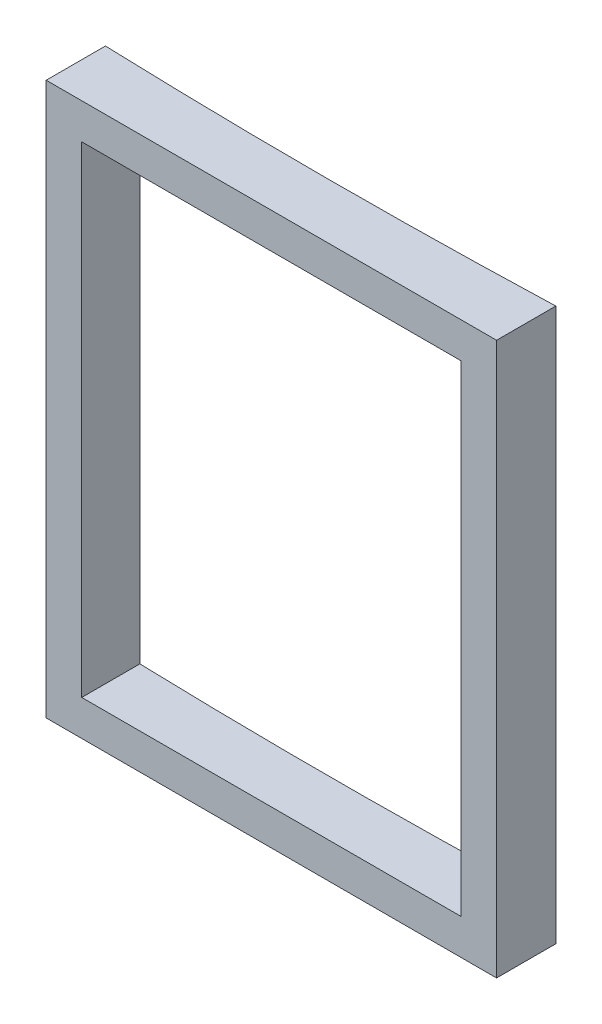
ISO-10303-21;
HEADER;
FILE_DESCRIPTION(('STEP AP214'),'2;1');
FILE_NAME('part.step','',(''),(''),'','','');
FILE_SCHEMA(('AUTOMOTIVE_DESIGN { 1 0 10303 214 1 1 1 1 }'));
ENDSEC;
DATA;
#1=APPLICATION_CONTEXT('core data for automotive mechanical design processes');
#2=APPLICATION_PROTOCOL_DEFINITION('international standard','automotive_design',2000,#1);
#3=PRODUCT_CONTEXT('',#1,'mechanical');
#4=PRODUCT('Part','Part','',(#3));
#5=PRODUCT_RELATED_PRODUCT_CATEGORY('part','',(#4));
#6=PRODUCT_DEFINITION_FORMATION('','',#4);
#7=PRODUCT_DEFINITION_CONTEXT('part definition',#1,'design');
#8=PRODUCT_DEFINITION('design','',#6,#7);
#9=PRODUCT_DEFINITION_SHAPE('','',#8);
#10=(LENGTH_UNIT() NAMED_UNIT(*) SI_UNIT(.MILLI.,.METRE.));
#11=(NAMED_UNIT(*) PLANE_ANGLE_UNIT() SI_UNIT($,.RADIAN.));
#12=(NAMED_UNIT(*) SI_UNIT($,.STERADIAN.) SOLID_ANGLE_UNIT());
#13=UNCERTAINTY_MEASURE_WITH_UNIT(LENGTH_MEASURE(1.E-05),#10,'distance_accuracy_value','');
#14=(GEOMETRIC_REPRESENTATION_CONTEXT(3) GLOBAL_UNCERTAINTY_ASSIGNED_CONTEXT((#13)) GLOBAL_UNIT_ASSIGNED_CONTEXT((#10,
#11,#12)) REPRESENTATION_CONTEXT('',''));
#15=CARTESIAN_POINT('',(0.,0.,0.));
#16=DIRECTION('',(0.,0.,1.));
#17=DIRECTION('',(1.,0.,0.));
#18=AXIS2_PLACEMENT_3D('',#15,#16,#17);
#19=CARTESIAN_POINT('',(-7642.18614314405,2330.,-22466.2180459366));
#20=DIRECTION('',(0.,-1.,0.));
#21=DIRECTION('',(0.,0.,-1.));
#22=AXIS2_PLACEMENT_3D('',#19,#20,#21);
#23=CYLINDRICAL_SURFACE('',#22,27500.);
#24=CARTESIAN_POINT('',(-7642.18614314405,150.,-22466.2180459366));
#25=DIRECTION('',(0.,-1.,0.));
#26=DIRECTION('',(1.,0.,0.));
#27=AXIS2_PLACEMENT_3D('',#24,#25,#26);
#28=CIRCLE('',#27,27500.);
#29=CARTESIAN_POINT('',(-8442.18614314405,150.,5022.14312747641));
#30=VERTEX_POINT('',#29);
#31=CARTESIAN_POINT('',(-6842.18614314405,150.,5022.14312747641));
#32=VERTEX_POINT('',#31);
#33=EDGE_CURVE('E150',#30,#32,#28,.F.);
#34=ORIENTED_EDGE('',*,*,#33,.T.);
#35=DIRECTION('',(0.,-1.,0.));
#36=VECTOR('',#35,1.);
#37=CARTESIAN_POINT('',(-6842.18614314405,2330.,5022.14312747641));
#38=LINE('',#37,#36);
#39=CARTESIAN_POINT('',(-6842.18614314405,2180.,5022.14312747641));
#40=VERTEX_POINT('',#39);
#41=EDGE_CURVE('E154',#32,#40,#38,.F.);
#42=ORIENTED_EDGE('',*,*,#41,.T.);
#43=CARTESIAN_POINT('',(-7642.18614314405,2180.,-22466.2180459366));
#44=DIRECTION('',(0.,1.,0.));
#45=DIRECTION('',(0.,0.,1.));
#46=AXIS2_PLACEMENT_3D('',#43,#44,#45);
#47=CIRCLE('',#46,27500.);
#48=CARTESIAN_POINT('',(-8442.18614314405,2180.,5022.14312747641));
#49=VERTEX_POINT('',#48);
#50=EDGE_CURVE('E141',#40,#49,#47,.F.);
#51=ORIENTED_EDGE('',*,*,#50,.T.);
#52=DIRECTION('',(0.,-1.,0.));
#53=VECTOR('',#52,1.);
#54=CARTESIAN_POINT('',(-8442.18614314405,2330.,5022.14312747641));
#55=LINE('',#54,#53);
#56=EDGE_CURVE('E116',#49,#30,#55,.T.);
#57=ORIENTED_EDGE('',*,*,#56,.T.);
#58=EDGE_LOOP('',(#34,#42,#51,#57));
#59=FACE_BOUND('',#58,.T.);
#60=CARTESIAN_POINT('',(-7642.18614314405,0.,-22466.2180459366));
#61=DIRECTION('',(0.,-1.,0.));
#62=DIRECTION('',(0.,0.,-1.));
#63=AXIS2_PLACEMENT_3D('',#60,#61,#62);
#64=CIRCLE('',#63,27500.);
#65=CARTESIAN_POINT('',(-6692.18614314405,0.,5017.36796462614));
#66=VERTEX_POINT('',#65);
#67=CARTESIAN_POINT('',(-8592.18614314405,0.,5017.36796462614));
#68=VERTEX_POINT('',#67);
#69=EDGE_CURVE('E158',#66,#68,#64,.T.);
#70=ORIENTED_EDGE('',*,*,#69,.T.);
#71=DIRECTION('',(0.,-1.,0.));
#72=VECTOR('',#71,1.);
#73=CARTESIAN_POINT('',(-8592.18614314405,2330.,5017.36796462614));
#74=LINE('',#73,#72);
#75=CARTESIAN_POINT('',(-8592.18614314405,2330.,5017.36796462614));
#76=VERTEX_POINT('',#75);
#77=EDGE_CURVE('E11',#76,#68,#74,.T.);
#78=ORIENTED_EDGE('',*,*,#77,.F.);
#79=CARTESIAN_POINT('',(-7642.18614314405,2330.,-22466.2180459366));
#80=DIRECTION('',(0.,-1.,0.));
#81=DIRECTION('',(0.,0.,-1.));
#82=AXIS2_PLACEMENT_3D('',#79,#80,#81);
#83=CIRCLE('',#82,27500.);
#84=CARTESIAN_POINT('',(-6692.18614314405,2330.,5017.36796462614));
#85=VERTEX_POINT('',#84);
#86=EDGE_CURVE('E159',#85,#76,#83,.T.);
#87=ORIENTED_EDGE('',*,*,#86,.F.);
#88=DIRECTION('',(0.,-1.,0.));
#89=VECTOR('',#88,1.);
#90=CARTESIAN_POINT('',(-6692.18614314405,2330.,5017.36796462614));
#91=LINE('',#90,#89);
#92=EDGE_CURVE('E173',#85,#66,#91,.T.);
#93=ORIENTED_EDGE('',*,*,#92,.T.);
#94=EDGE_LOOP('',(#70,#78,#87,#93));
#95=FACE_BOUND('',#94,.T.);
#96=ADVANCED_FACE('F45',(#59,#95),#23,.F.);
#97=CARTESIAN_POINT('',(-8592.18614314405,2330.,5017.36796462614));
#98=DIRECTION('',(1.,0.,0.));
#99=DIRECTION('',(0.,0.,-1.));
#100=AXIS2_PLACEMENT_3D('',#97,#98,#99);
#101=PLANE('',#100);
#102=DIRECTION('',(0.,0.,1.));
#103=VECTOR('',#102,1.);
#104=CARTESIAN_POINT('',(-8592.18614314405,0.,5017.36796462614));
#105=LINE('',#104,#103);
#106=CARTESIAN_POINT('',(-8592.18614314405,0.,5267.36796462614));
#107=VERTEX_POINT('',#106);
#108=EDGE_CURVE('E177',#68,#107,#105,.T.);
#109=ORIENTED_EDGE('',*,*,#108,.T.);
#110=DIRECTION('',(0.,-1.,0.));
#111=VECTOR('',#110,1.);
#112=CARTESIAN_POINT('',(-8592.18614314405,2330.,5267.36796462614));
#113=LINE('',#112,#111);
#114=CARTESIAN_POINT('',(-8592.18614314405,2330.,5267.36796462614));
#115=VERTEX_POINT('',#114);
#116=EDGE_CURVE('E53',#115,#107,#113,.T.);
#117=ORIENTED_EDGE('',*,*,#116,.F.);
#118=DIRECTION('',(0.,0.,1.));
#119=VECTOR('',#118,1.);
#120=CARTESIAN_POINT('',(-8592.18614314405,2330.,5017.36796462614));
#121=LINE('',#120,#119);
#122=EDGE_CURVE('E163',#76,#115,#121,.T.);
#123=ORIENTED_EDGE('',*,*,#122,.F.);
#124=ORIENTED_EDGE('',*,*,#77,.T.);
#125=EDGE_LOOP('',(#109,#117,#123,#124));
#126=FACE_BOUND('',#125,.T.);
#127=ADVANCED_FACE('F211',(#126),#101,.F.);
#128=CARTESIAN_POINT('',(-8592.18614314405,2330.,5267.36796462614));
#129=DIRECTION('',(0.,0.,-1.));
#130=DIRECTION('',(-1.,0.,0.));
#131=AXIS2_PLACEMENT_3D('',#128,#129,#130);
#132=PLANE('',#131);
#133=DIRECTION('',(-1.,0.,0.));
#134=VECTOR('',#133,1.);
#135=CARTESIAN_POINT('',(-8442.18614314405,2180.,5267.36796462614));
#136=LINE('',#135,#134);
#137=CARTESIAN_POINT('',(-6842.18614314405,2180.,5267.36796462614));
#138=VERTEX_POINT('',#137);
#139=CARTESIAN_POINT('',(-8442.18614314405,2180.,5267.36796462614));
#140=VERTEX_POINT('',#139);
#141=EDGE_CURVE('E123',#138,#140,#136,.T.);
#142=ORIENTED_EDGE('',*,*,#141,.F.);
#143=DIRECTION('',(0.,1.,0.));
#144=VECTOR('',#143,1.);
#145=CARTESIAN_POINT('',(-6842.18614314405,2180.,5267.36796462614));
#146=LINE('',#145,#144);
#147=CARTESIAN_POINT('',(-6842.18614314405,150.,5267.36796462614));
#148=VERTEX_POINT('',#147);
#149=EDGE_CURVE('E68',#148,#138,#146,.T.);
#150=ORIENTED_EDGE('',*,*,#149,.F.);
#151=DIRECTION('',(1.,0.,0.));
#152=VECTOR('',#151,1.);
#153=CARTESIAN_POINT('',(-6842.18614314405,150.,5267.36796462614));
#154=LINE('',#153,#152);
#155=CARTESIAN_POINT('',(-8442.18614314405,150.,5267.36796462614));
#156=VERTEX_POINT('',#155);
#157=EDGE_CURVE('E131',#156,#148,#154,.T.);
#158=ORIENTED_EDGE('',*,*,#157,.F.);
#159=DIRECTION('',(0.,-1.,0.));
#160=VECTOR('',#159,1.);
#161=CARTESIAN_POINT('',(-8442.18614314405,150.,5267.36796462614));
#162=LINE('',#161,#160);
#163=EDGE_CURVE('E113',#140,#156,#162,.T.);
#164=ORIENTED_EDGE('',*,*,#163,.F.);
#165=EDGE_LOOP('',(#142,#150,#158,#164));
#166=FACE_BOUND('',#165,.T.);
#167=DIRECTION('',(1.,0.,0.));
#168=VECTOR('',#167,1.);
#169=CARTESIAN_POINT('',(-8592.18614314405,0.,5267.36796462614));
#170=LINE('',#169,#168);
#171=CARTESIAN_POINT('',(-6692.18614314405,0.,5267.36796462614));
#172=VERTEX_POINT('',#171);
#173=EDGE_CURVE('E180',#107,#172,#170,.T.);
#174=ORIENTED_EDGE('',*,*,#173,.T.);
#175=DIRECTION('',(0.,-1.,0.));
#176=VECTOR('',#175,1.);
#177=CARTESIAN_POINT('',(-6692.18614314405,2330.,5267.36796462614));
#178=LINE('',#177,#176);
#179=CARTESIAN_POINT('',(-6692.18614314405,2330.,5267.36796462614));
#180=VERTEX_POINT('',#179);
#181=EDGE_CURVE('E188',#180,#172,#178,.T.);
#182=ORIENTED_EDGE('',*,*,#181,.F.);
#183=DIRECTION('',(1.,0.,0.));
#184=VECTOR('',#183,1.);
#185=CARTESIAN_POINT('',(-8592.18614314405,2330.,5267.36796462614));
#186=LINE('',#185,#184);
#187=EDGE_CURVE('E167',#115,#180,#186,.T.);
#188=ORIENTED_EDGE('',*,*,#187,.F.);
#189=ORIENTED_EDGE('',*,*,#116,.T.);
#190=EDGE_LOOP('',(#174,#182,#188,#189));
#191=FACE_BOUND('',#190,.T.);
#192=ADVANCED_FACE('F128',(#166,#191),#132,.F.);
#193=CARTESIAN_POINT('',(-6692.18614314405,2330.,5017.36796462614));
#194=DIRECTION('',(-1.,0.,0.));
#195=DIRECTION('',(0.,0.,1.));
#196=AXIS2_PLACEMENT_3D('',#193,#194,#195);
#197=PLANE('',#196);
#198=DIRECTION('',(0.,0.,-1.));
#199=VECTOR('',#198,1.);
#200=CARTESIAN_POINT('',(-6692.18614314405,0.,5017.36796462614));
#201=LINE('',#200,#199);
#202=EDGE_CURVE('E164',#172,#66,#201,.T.);
#203=ORIENTED_EDGE('',*,*,#202,.T.);
#204=ORIENTED_EDGE('',*,*,#92,.F.);
#205=DIRECTION('',(0.,0.,-1.));
#206=VECTOR('',#205,1.);
#207=CARTESIAN_POINT('',(-6692.18614314405,2330.,5017.36796462614));
#208=LINE('',#207,#206);
#209=EDGE_CURVE('E170',#180,#85,#208,.T.);
#210=ORIENTED_EDGE('',*,*,#209,.F.);
#211=ORIENTED_EDGE('',*,*,#181,.T.);
#212=EDGE_LOOP('',(#203,#204,#210,#211));
#213=FACE_BOUND('',#212,.T.);
#214=ADVANCED_FACE('F204',(#213),#197,.F.);
#215=CARTESIAN_POINT('',(-7642.18614314405,2330.,-22466.2180459366));
#216=DIRECTION('',(0.,-1.,0.));
#217=DIRECTION('',(0.,0.,-1.));
#218=AXIS2_PLACEMENT_3D('',#215,#216,#217);
#219=PLANE('',#218);
#220=ORIENTED_EDGE('',*,*,#86,.T.);
#221=ORIENTED_EDGE('',*,*,#122,.T.);
#222=ORIENTED_EDGE('',*,*,#187,.T.);
#223=ORIENTED_EDGE('',*,*,#209,.T.);
#224=EDGE_LOOP('',(#220,#221,#222,#223));
#225=FACE_BOUND('',#224,.T.);
#226=ADVANCED_FACE('F210',(#225),#219,.F.);
#227=CARTESIAN_POINT('',(-7642.18614314405,0.,-22466.2180459366));
#228=DIRECTION('',(0.,-1.,0.));
#229=DIRECTION('',(0.,0.,-1.));
#230=AXIS2_PLACEMENT_3D('',#227,#228,#229);
#231=PLANE('',#230);
#232=ORIENTED_EDGE('',*,*,#69,.F.);
#233=ORIENTED_EDGE('',*,*,#202,.F.);
#234=ORIENTED_EDGE('',*,*,#173,.F.);
#235=ORIENTED_EDGE('',*,*,#108,.F.);
#236=EDGE_LOOP('',(#232,#233,#234,#235));
#237=FACE_BOUND('',#236,.T.);
#238=ADVANCED_FACE('F201',(#237),#231,.T.);
#239=CARTESIAN_POINT('',(-6842.18614314405,2180.,2267.36796462614));
#240=DIRECTION('',(1.,0.,0.));
#241=DIRECTION('',(0.,0.,-1.));
#242=AXIS2_PLACEMENT_3D('',#239,#240,#241);
#243=PLANE('',#242);
#244=DIRECTION('',(0.,0.,1.));
#245=VECTOR('',#244,1.);
#246=CARTESIAN_POINT('',(-6842.18614314405,150.,2267.36796462614));
#247=LINE('',#246,#245);
#248=EDGE_CURVE('E138',#32,#148,#247,.T.);
#249=ORIENTED_EDGE('',*,*,#248,.T.);
#250=ORIENTED_EDGE('',*,*,#149,.T.);
#251=DIRECTION('',(0.,0.,1.));
#252=VECTOR('',#251,1.);
#253=CARTESIAN_POINT('',(-6842.18614314405,2180.,2267.36796462614));
#254=LINE('',#253,#252);
#255=EDGE_CURVE('E120',#40,#138,#254,.T.);
#256=ORIENTED_EDGE('',*,*,#255,.F.);
#257=ORIENTED_EDGE('',*,*,#41,.F.);
#258=EDGE_LOOP('',(#249,#250,#256,#257));
#259=FACE_BOUND('',#258,.T.);
#260=ADVANCED_FACE('F224',(#259),#243,.F.);
#261=CARTESIAN_POINT('',(-6842.18614314405,150.,2267.36796462614));
#262=DIRECTION('',(0.,-1.,0.));
#263=DIRECTION('',(1.,0.,0.));
#264=AXIS2_PLACEMENT_3D('',#261,#262,#263);
#265=PLANE('',#264);
#266=DIRECTION('',(0.,0.,1.));
#267=VECTOR('',#266,1.);
#268=CARTESIAN_POINT('',(-8442.18614314405,150.,2267.36796462614));
#269=LINE('',#268,#267);
#270=EDGE_CURVE('E119',#30,#156,#269,.T.);
#271=ORIENTED_EDGE('',*,*,#270,.T.);
#272=ORIENTED_EDGE('',*,*,#157,.T.);
#273=ORIENTED_EDGE('',*,*,#248,.F.);
#274=ORIENTED_EDGE('',*,*,#33,.F.);
#275=EDGE_LOOP('',(#271,#272,#273,#274));
#276=FACE_BOUND('',#275,.T.);
#277=ADVANCED_FACE('F229',(#276),#265,.F.);
#278=CARTESIAN_POINT('',(-8442.18614314405,150.,2267.36796462614));
#279=DIRECTION('',(-1.,0.,0.));
#280=DIRECTION('',(0.,0.,1.));
#281=AXIS2_PLACEMENT_3D('',#278,#279,#280);
#282=PLANE('',#281);
#283=DIRECTION('',(0.,0.,1.));
#284=VECTOR('',#283,1.);
#285=CARTESIAN_POINT('',(-8442.18614314405,2180.,2267.36796462614));
#286=LINE('',#285,#284);
#287=EDGE_CURVE('E60',#49,#140,#286,.T.);
#288=ORIENTED_EDGE('',*,*,#287,.T.);
#289=ORIENTED_EDGE('',*,*,#163,.T.);
#290=ORIENTED_EDGE('',*,*,#270,.F.);
#291=ORIENTED_EDGE('',*,*,#56,.F.);
#292=EDGE_LOOP('',(#288,#289,#290,#291));
#293=FACE_BOUND('',#292,.T.);
#294=ADVANCED_FACE('F110',(#293),#282,.F.);
#295=CARTESIAN_POINT('',(-8442.18614314405,2180.,2267.36796462614));
#296=DIRECTION('',(0.,1.,0.));
#297=DIRECTION('',(0.,0.,1.));
#298=AXIS2_PLACEMENT_3D('',#295,#296,#297);
#299=PLANE('',#298);
#300=ORIENTED_EDGE('',*,*,#255,.T.);
#301=ORIENTED_EDGE('',*,*,#141,.T.);
#302=ORIENTED_EDGE('',*,*,#287,.F.);
#303=ORIENTED_EDGE('',*,*,#50,.F.);
#304=EDGE_LOOP('',(#300,#301,#302,#303));
#305=FACE_BOUND('',#304,.T.);
#306=ADVANCED_FACE('F124',(#305),#299,.F.);
#307=CLOSED_SHELL('',(#96,#127,#192,#214,#226,#238,#260,#277,#294,#306));
#308=MANIFOLD_SOLID_BREP('B2',#307);
#309=ADVANCED_BREP_SHAPE_REPRESENTATION('',(#18,#308),#14);
#310=SHAPE_DEFINITION_REPRESENTATION(#9,#309);
ENDSEC;
END-ISO-10303-21;
